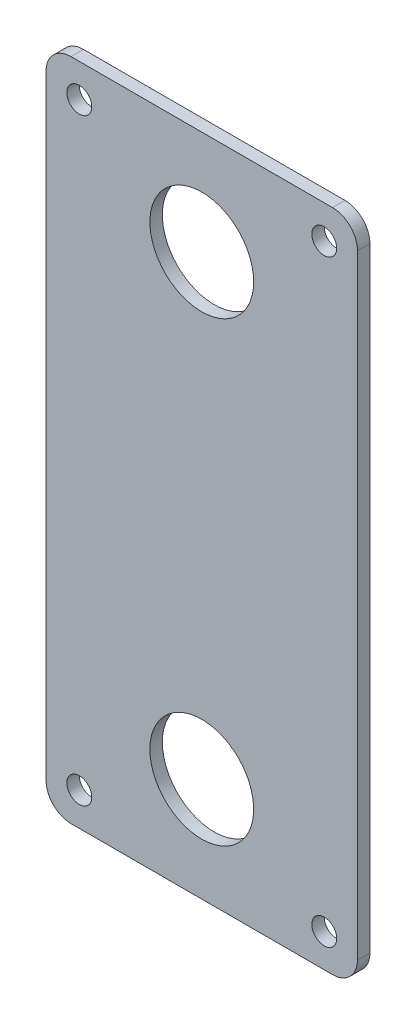
ISO-10303-21;
HEADER;
FILE_DESCRIPTION(('STEP AP214'),'2;1');
FILE_NAME('part.step','',(''),(''),'','','');
FILE_SCHEMA(('AUTOMOTIVE_DESIGN { 1 0 10303 214 1 1 1 1 }'));
ENDSEC;
DATA;
#1=APPLICATION_CONTEXT('core data for automotive mechanical design processes');
#2=APPLICATION_PROTOCOL_DEFINITION('international standard','automotive_design',2000,#1);
#3=PRODUCT_CONTEXT('',#1,'mechanical');
#4=PRODUCT('Part','Part','',(#3));
#5=PRODUCT_RELATED_PRODUCT_CATEGORY('part','',(#4));
#6=PRODUCT_DEFINITION_FORMATION('','',#4);
#7=PRODUCT_DEFINITION_CONTEXT('part definition',#1,'design');
#8=PRODUCT_DEFINITION('design','',#6,#7);
#9=PRODUCT_DEFINITION_SHAPE('','',#8);
#10=(LENGTH_UNIT() NAMED_UNIT(*) SI_UNIT(.MILLI.,.METRE.));
#11=(NAMED_UNIT(*) PLANE_ANGLE_UNIT() SI_UNIT($,.RADIAN.));
#12=(NAMED_UNIT(*) SI_UNIT($,.STERADIAN.) SOLID_ANGLE_UNIT());
#13=UNCERTAINTY_MEASURE_WITH_UNIT(LENGTH_MEASURE(1.E-05),#10,'distance_accuracy_value','');
#14=(GEOMETRIC_REPRESENTATION_CONTEXT(3) GLOBAL_UNCERTAINTY_ASSIGNED_CONTEXT((#13)) GLOBAL_UNIT_ASSIGNED_CONTEXT((#10,
#11,#12)) REPRESENTATION_CONTEXT('',''));
#15=CARTESIAN_POINT('',(0.,0.,0.));
#16=DIRECTION('',(0.,0.,1.));
#17=DIRECTION('',(1.,0.,0.));
#18=AXIS2_PLACEMENT_3D('',#15,#16,#17);
#19=CARTESIAN_POINT('',(0.,0.,3.));
#20=DIRECTION('',(0.,0.,-1.));
#21=DIRECTION('',(-1.,0.,0.));
#22=AXIS2_PLACEMENT_3D('',#19,#20,#21);
#23=PLANE('',#22);
#24=DIRECTION('',(0.,-1.,0.));
#25=VECTOR('',#24,1.);
#26=CARTESIAN_POINT('',(-37.5,80.,3.));
#27=LINE('',#26,#25);
#28=CARTESIAN_POINT('',(-37.5,74.,3.));
#29=VERTEX_POINT('',#28);
#30=CARTESIAN_POINT('',(-37.5,-74.,3.));
#31=VERTEX_POINT('',#30);
#32=EDGE_CURVE('E137',#29,#31,#27,.T.);
#33=ORIENTED_EDGE('',*,*,#32,.T.);
#34=CARTESIAN_POINT('',(-31.5,-74.,3.));
#35=DIRECTION('',(0.,0.,-1.));
#36=DIRECTION('',(-1.,0.,0.));
#37=AXIS2_PLACEMENT_3D('',#34,#35,#36);
#38=CIRCLE('',#37,6.);
#39=CARTESIAN_POINT('',(-31.5,-80.,3.));
#40=VERTEX_POINT('',#39);
#41=EDGE_CURVE('E152',#31,#40,#38,.F.);
#42=ORIENTED_EDGE('',*,*,#41,.T.);
#43=DIRECTION('',(1.,0.,0.));
#44=VECTOR('',#43,1.);
#45=CARTESIAN_POINT('',(37.5,-80.,3.));
#46=LINE('',#45,#44);
#47=CARTESIAN_POINT('',(31.5,-80.,3.));
#48=VERTEX_POINT('',#47);
#49=EDGE_CURVE('E119',#40,#48,#46,.T.);
#50=ORIENTED_EDGE('',*,*,#49,.T.);
#51=CARTESIAN_POINT('',(31.5,-74.,3.));
#52=DIRECTION('',(0.,0.,-1.));
#53=DIRECTION('',(-1.,0.,0.));
#54=AXIS2_PLACEMENT_3D('',#51,#52,#53);
#55=CIRCLE('',#54,6.);
#56=CARTESIAN_POINT('',(37.5,-74.,3.));
#57=VERTEX_POINT('',#56);
#58=EDGE_CURVE('E147',#48,#57,#55,.F.);
#59=ORIENTED_EDGE('',*,*,#58,.T.);
#60=DIRECTION('',(0.,1.,0.));
#61=VECTOR('',#60,1.);
#62=CARTESIAN_POINT('',(37.5,80.,3.));
#63=LINE('',#62,#61);
#64=CARTESIAN_POINT('',(37.5,74.,3.));
#65=VERTEX_POINT('',#64);
#66=EDGE_CURVE('E163',#57,#65,#63,.T.);
#67=ORIENTED_EDGE('',*,*,#66,.T.);
#68=CARTESIAN_POINT('',(31.5,74.,3.));
#69=DIRECTION('',(0.,0.,-1.));
#70=DIRECTION('',(-1.,0.,0.));
#71=AXIS2_PLACEMENT_3D('',#68,#69,#70);
#72=CIRCLE('',#71,6.);
#73=CARTESIAN_POINT('',(31.5,80.,3.));
#74=VERTEX_POINT('',#73);
#75=EDGE_CURVE('E55',#65,#74,#72,.F.);
#76=ORIENTED_EDGE('',*,*,#75,.T.);
#77=DIRECTION('',(-1.,0.,0.));
#78=VECTOR('',#77,1.);
#79=CARTESIAN_POINT('',(37.5,80.,3.));
#80=LINE('',#79,#78);
#81=CARTESIAN_POINT('',(-31.5,80.,3.));
#82=VERTEX_POINT('',#81);
#83=EDGE_CURVE('E138',#74,#82,#80,.T.);
#84=ORIENTED_EDGE('',*,*,#83,.T.);
#85=CARTESIAN_POINT('',(-31.5,74.,3.));
#86=DIRECTION('',(0.,0.,-1.));
#87=DIRECTION('',(-1.,0.,0.));
#88=AXIS2_PLACEMENT_3D('',#85,#86,#87);
#89=CIRCLE('',#88,6.);
#90=EDGE_CURVE('E150',#82,#29,#89,.F.);
#91=ORIENTED_EDGE('',*,*,#90,.T.);
#92=EDGE_LOOP('',(#33,#42,#50,#59,#67,#76,#84,#91));
#93=FACE_BOUND('',#92,.T.);
#94=CARTESIAN_POINT('',(0.,55.,3.));
#95=DIRECTION('',(0.,0.,1.));
#96=DIRECTION('',(1.,0.,0.));
#97=AXIS2_PLACEMENT_3D('',#94,#95,#96);
#98=CIRCLE('',#97,12.5);
#99=CARTESIAN_POINT('',(12.5,55.,3.));
#100=VERTEX_POINT('',#99);
#101=EDGE_CURVE('E132',#100,#100,#98,.T.);
#102=ORIENTED_EDGE('',*,*,#101,.F.);
#103=EDGE_LOOP('',(#102));
#104=FACE_BOUND('',#103,.T.);
#105=CARTESIAN_POINT('',(0.,-55.,3.));
#106=DIRECTION('',(0.,0.,1.));
#107=DIRECTION('',(-1.,0.,0.));
#108=AXIS2_PLACEMENT_3D('',#105,#106,#107);
#109=CIRCLE('',#108,12.5);
#110=CARTESIAN_POINT('',(-12.5,-55.,3.));
#111=VERTEX_POINT('',#110);
#112=EDGE_CURVE('E180',#111,#111,#109,.T.);
#113=ORIENTED_EDGE('',*,*,#112,.F.);
#114=EDGE_LOOP('',(#113));
#115=FACE_BOUND('',#114,.T.);
#116=CARTESIAN_POINT('',(-29.5,72.,3.));
#117=DIRECTION('',(0.,0.,1.));
#118=DIRECTION('',(1.,0.,0.));
#119=AXIS2_PLACEMENT_3D('',#116,#117,#118);
#120=CIRCLE('',#119,3.);
#121=CARTESIAN_POINT('',(-26.5,72.,3.));
#122=VERTEX_POINT('',#121);
#123=EDGE_CURVE('E186',#122,#122,#120,.T.);
#124=ORIENTED_EDGE('',*,*,#123,.F.);
#125=EDGE_LOOP('',(#124));
#126=FACE_BOUND('',#125,.T.);
#127=CARTESIAN_POINT('',(29.5,72.,3.));
#128=DIRECTION('',(0.,0.,1.));
#129=DIRECTION('',(-1.,0.,0.));
#130=AXIS2_PLACEMENT_3D('',#127,#128,#129);
#131=CIRCLE('',#130,3.);
#132=CARTESIAN_POINT('',(26.5,72.,3.));
#133=VERTEX_POINT('',#132);
#134=EDGE_CURVE('E192',#133,#133,#131,.T.);
#135=ORIENTED_EDGE('',*,*,#134,.F.);
#136=EDGE_LOOP('',(#135));
#137=FACE_BOUND('',#136,.T.);
#138=CARTESIAN_POINT('',(-29.5,-72.,3.));
#139=DIRECTION('',(0.,0.,1.));
#140=DIRECTION('',(-1.,0.,0.));
#141=AXIS2_PLACEMENT_3D('',#138,#139,#140);
#142=CIRCLE('',#141,3.);
#143=CARTESIAN_POINT('',(-32.5,-72.,3.));
#144=VERTEX_POINT('',#143);
#145=EDGE_CURVE('E198',#144,#144,#142,.T.);
#146=ORIENTED_EDGE('',*,*,#145,.F.);
#147=EDGE_LOOP('',(#146));
#148=FACE_BOUND('',#147,.T.);
#149=CARTESIAN_POINT('',(29.5,-72.,3.));
#150=DIRECTION('',(0.,0.,1.));
#151=DIRECTION('',(1.,0.,0.));
#152=AXIS2_PLACEMENT_3D('',#149,#150,#151);
#153=CIRCLE('',#152,3.);
#154=CARTESIAN_POINT('',(32.5,-72.,3.));
#155=VERTEX_POINT('',#154);
#156=EDGE_CURVE('E204',#155,#155,#153,.T.);
#157=ORIENTED_EDGE('',*,*,#156,.F.);
#158=EDGE_LOOP('',(#157));
#159=FACE_BOUND('',#158,.T.);
#160=ADVANCED_FACE('F33',(#93,#104,#115,#126,#137,#148,#159),#23,.F.);
#161=CARTESIAN_POINT('',(0.,0.,0.));
#162=DIRECTION('',(0.,0.,-1.));
#163=DIRECTION('',(-1.,0.,0.));
#164=AXIS2_PLACEMENT_3D('',#161,#162,#163);
#165=PLANE('',#164);
#166=CARTESIAN_POINT('',(-29.5,-72.,0.));
#167=DIRECTION('',(0.,0.,1.));
#168=DIRECTION('',(-1.,0.,0.));
#169=AXIS2_PLACEMENT_3D('',#166,#167,#168);
#170=CIRCLE('',#169,3.);
#171=CARTESIAN_POINT('',(-32.5,-72.,0.));
#172=VERTEX_POINT('',#171);
#173=EDGE_CURVE('E201',#172,#172,#170,.T.);
#174=ORIENTED_EDGE('',*,*,#173,.T.);
#175=EDGE_LOOP('',(#174));
#176=FACE_BOUND('',#175,.T.);
#177=CARTESIAN_POINT('',(-29.5,72.,0.));
#178=DIRECTION('',(0.,0.,1.));
#179=DIRECTION('',(1.,0.,0.));
#180=AXIS2_PLACEMENT_3D('',#177,#178,#179);
#181=CIRCLE('',#180,3.);
#182=CARTESIAN_POINT('',(-26.5,72.,0.));
#183=VERTEX_POINT('',#182);
#184=EDGE_CURVE('E189',#183,#183,#181,.T.);
#185=ORIENTED_EDGE('',*,*,#184,.T.);
#186=EDGE_LOOP('',(#185));
#187=FACE_BOUND('',#186,.T.);
#188=CARTESIAN_POINT('',(0.,55.,0.));
#189=DIRECTION('',(0.,0.,1.));
#190=DIRECTION('',(1.,0.,0.));
#191=AXIS2_PLACEMENT_3D('',#188,#189,#190);
#192=CIRCLE('',#191,12.5);
#193=CARTESIAN_POINT('',(12.5,55.,0.));
#194=VERTEX_POINT('',#193);
#195=EDGE_CURVE('E177',#194,#194,#192,.T.);
#196=ORIENTED_EDGE('',*,*,#195,.T.);
#197=EDGE_LOOP('',(#196));
#198=FACE_BOUND('',#197,.T.);
#199=DIRECTION('',(1.,0.,0.));
#200=VECTOR('',#199,1.);
#201=CARTESIAN_POINT('',(37.5,-80.,0.));
#202=LINE('',#201,#200);
#203=CARTESIAN_POINT('',(-31.5,-80.,0.));
#204=VERTEX_POINT('',#203);
#205=CARTESIAN_POINT('',(31.5,-80.,0.));
#206=VERTEX_POINT('',#205);
#207=EDGE_CURVE('E116',#204,#206,#202,.T.);
#208=ORIENTED_EDGE('',*,*,#207,.F.);
#209=CARTESIAN_POINT('',(-31.5,-74.,0.));
#210=DIRECTION('',(0.,0.,-1.));
#211=DIRECTION('',(-1.,0.,0.));
#212=AXIS2_PLACEMENT_3D('',#209,#210,#211);
#213=CIRCLE('',#212,6.);
#214=CARTESIAN_POINT('',(-37.5,-74.,0.));
#215=VERTEX_POINT('',#214);
#216=EDGE_CURVE('E99',#204,#215,#213,.T.);
#217=ORIENTED_EDGE('',*,*,#216,.T.);
#218=DIRECTION('',(0.,-1.,0.));
#219=VECTOR('',#218,1.);
#220=CARTESIAN_POINT('',(-37.5,80.,0.));
#221=LINE('',#220,#219);
#222=CARTESIAN_POINT('',(-37.5,74.,0.));
#223=VERTEX_POINT('',#222);
#224=EDGE_CURVE('E127',#223,#215,#221,.T.);
#225=ORIENTED_EDGE('',*,*,#224,.F.);
#226=CARTESIAN_POINT('',(-31.5,74.,0.));
#227=DIRECTION('',(0.,0.,-1.));
#228=DIRECTION('',(-1.,0.,0.));
#229=AXIS2_PLACEMENT_3D('',#226,#227,#228);
#230=CIRCLE('',#229,6.);
#231=CARTESIAN_POINT('',(-31.5,80.,0.));
#232=VERTEX_POINT('',#231);
#233=EDGE_CURVE('E110',#223,#232,#230,.T.);
#234=ORIENTED_EDGE('',*,*,#233,.T.);
#235=DIRECTION('',(-1.,0.,0.));
#236=VECTOR('',#235,1.);
#237=CARTESIAN_POINT('',(37.5,80.,0.));
#238=LINE('',#237,#236);
#239=CARTESIAN_POINT('',(31.5,80.,0.));
#240=VERTEX_POINT('',#239);
#241=EDGE_CURVE('E130',#240,#232,#238,.T.);
#242=ORIENTED_EDGE('',*,*,#241,.F.);
#243=CARTESIAN_POINT('',(31.5,74.,0.));
#244=DIRECTION('',(0.,0.,-1.));
#245=DIRECTION('',(-1.,0.,0.));
#246=AXIS2_PLACEMENT_3D('',#243,#244,#245);
#247=CIRCLE('',#246,6.);
#248=CARTESIAN_POINT('',(37.5,74.,0.));
#249=VERTEX_POINT('',#248);
#250=EDGE_CURVE('E141',#240,#249,#247,.T.);
#251=ORIENTED_EDGE('',*,*,#250,.T.);
#252=DIRECTION('',(0.,1.,0.));
#253=VECTOR('',#252,1.);
#254=CARTESIAN_POINT('',(37.5,80.,0.));
#255=LINE('',#254,#253);
#256=CARTESIAN_POINT('',(37.5,-74.,0.));
#257=VERTEX_POINT('',#256);
#258=EDGE_CURVE('E126',#257,#249,#255,.T.);
#259=ORIENTED_EDGE('',*,*,#258,.F.);
#260=CARTESIAN_POINT('',(31.5,-74.,0.));
#261=DIRECTION('',(0.,0.,-1.));
#262=DIRECTION('',(-1.,0.,0.));
#263=AXIS2_PLACEMENT_3D('',#260,#261,#262);
#264=CIRCLE('',#263,6.);
#265=EDGE_CURVE('E120',#257,#206,#264,.T.);
#266=ORIENTED_EDGE('',*,*,#265,.T.);
#267=EDGE_LOOP('',(#208,#217,#225,#234,#242,#251,#259,#266));
#268=FACE_BOUND('',#267,.T.);
#269=CARTESIAN_POINT('',(0.,-55.,0.));
#270=DIRECTION('',(0.,0.,1.));
#271=DIRECTION('',(-1.,0.,0.));
#272=AXIS2_PLACEMENT_3D('',#269,#270,#271);
#273=CIRCLE('',#272,12.5);
#274=CARTESIAN_POINT('',(-12.5,-55.,0.));
#275=VERTEX_POINT('',#274);
#276=EDGE_CURVE('E183',#275,#275,#273,.T.);
#277=ORIENTED_EDGE('',*,*,#276,.T.);
#278=EDGE_LOOP('',(#277));
#279=FACE_BOUND('',#278,.T.);
#280=CARTESIAN_POINT('',(29.5,72.,0.));
#281=DIRECTION('',(0.,0.,1.));
#282=DIRECTION('',(-1.,0.,0.));
#283=AXIS2_PLACEMENT_3D('',#280,#281,#282);
#284=CIRCLE('',#283,3.);
#285=CARTESIAN_POINT('',(26.5,72.,0.));
#286=VERTEX_POINT('',#285);
#287=EDGE_CURVE('E195',#286,#286,#284,.T.);
#288=ORIENTED_EDGE('',*,*,#287,.T.);
#289=EDGE_LOOP('',(#288));
#290=FACE_BOUND('',#289,.T.);
#291=CARTESIAN_POINT('',(29.5,-72.,0.));
#292=DIRECTION('',(0.,0.,1.));
#293=DIRECTION('',(1.,0.,0.));
#294=AXIS2_PLACEMENT_3D('',#291,#292,#293);
#295=CIRCLE('',#294,3.);
#296=CARTESIAN_POINT('',(32.5,-72.,0.));
#297=VERTEX_POINT('',#296);
#298=EDGE_CURVE('E207',#297,#297,#295,.T.);
#299=ORIENTED_EDGE('',*,*,#298,.T.);
#300=EDGE_LOOP('',(#299));
#301=FACE_BOUND('',#300,.T.);
#302=ADVANCED_FACE('F123',(#176,#187,#198,#268,#279,#290,#301),#165,.T.);
#303=CARTESIAN_POINT('',(-37.5,80.,3.));
#304=DIRECTION('',(1.,0.,0.));
#305=DIRECTION('',(0.,1.,0.));
#306=AXIS2_PLACEMENT_3D('',#303,#304,#305);
#307=PLANE('',#306);
#308=ORIENTED_EDGE('',*,*,#224,.T.);
#309=DIRECTION('',(0.,0.,-1.));
#310=VECTOR('',#309,1.);
#311=CARTESIAN_POINT('',(-37.5,-74.,3.));
#312=LINE('',#311,#310);
#313=EDGE_CURVE('E104',#215,#31,#312,.F.);
#314=ORIENTED_EDGE('',*,*,#313,.T.);
#315=ORIENTED_EDGE('',*,*,#32,.F.);
#316=DIRECTION('',(0.,0.,-1.));
#317=VECTOR('',#316,1.);
#318=CARTESIAN_POINT('',(-37.5,74.,3.));
#319=LINE('',#318,#317);
#320=EDGE_CURVE('E109',#29,#223,#319,.T.);
#321=ORIENTED_EDGE('',*,*,#320,.T.);
#322=EDGE_LOOP('',(#308,#314,#315,#321));
#323=FACE_BOUND('',#322,.T.);
#324=ADVANCED_FACE('F221',(#323),#307,.F.);
#325=CARTESIAN_POINT('',(37.5,-80.,3.));
#326=DIRECTION('',(0.,1.,0.));
#327=DIRECTION('',(-1.,0.,0.));
#328=AXIS2_PLACEMENT_3D('',#325,#326,#327);
#329=PLANE('',#328);
#330=ORIENTED_EDGE('',*,*,#49,.F.);
#331=DIRECTION('',(0.,0.,-1.));
#332=VECTOR('',#331,1.);
#333=CARTESIAN_POINT('',(-31.5,-80.,3.));
#334=LINE('',#333,#332);
#335=EDGE_CURVE('E103',#40,#204,#334,.T.);
#336=ORIENTED_EDGE('',*,*,#335,.T.);
#337=ORIENTED_EDGE('',*,*,#207,.T.);
#338=DIRECTION('',(0.,0.,-1.));
#339=VECTOR('',#338,1.);
#340=CARTESIAN_POINT('',(31.5,-80.,3.));
#341=LINE('',#340,#339);
#342=EDGE_CURVE('E121',#206,#48,#341,.F.);
#343=ORIENTED_EDGE('',*,*,#342,.T.);
#344=EDGE_LOOP('',(#330,#336,#337,#343));
#345=FACE_BOUND('',#344,.T.);
#346=ADVANCED_FACE('F115',(#345),#329,.F.);
#347=CARTESIAN_POINT('',(37.5,80.,3.));
#348=DIRECTION('',(-1.,0.,0.));
#349=DIRECTION('',(0.,-1.,0.));
#350=AXIS2_PLACEMENT_3D('',#347,#348,#349);
#351=PLANE('',#350);
#352=ORIENTED_EDGE('',*,*,#258,.T.);
#353=DIRECTION('',(0.,0.,-1.));
#354=VECTOR('',#353,1.);
#355=CARTESIAN_POINT('',(37.5,74.,3.));
#356=LINE('',#355,#354);
#357=EDGE_CURVE('E11',#249,#65,#356,.F.);
#358=ORIENTED_EDGE('',*,*,#357,.T.);
#359=ORIENTED_EDGE('',*,*,#66,.F.);
#360=DIRECTION('',(0.,0.,-1.));
#361=VECTOR('',#360,1.);
#362=CARTESIAN_POINT('',(37.5,-74.,3.));
#363=LINE('',#362,#361);
#364=EDGE_CURVE('E41',#57,#257,#363,.T.);
#365=ORIENTED_EDGE('',*,*,#364,.T.);
#366=EDGE_LOOP('',(#352,#358,#359,#365));
#367=FACE_BOUND('',#366,.T.);
#368=ADVANCED_FACE('F161',(#367),#351,.F.);
#369=CARTESIAN_POINT('',(37.5,80.,3.));
#370=DIRECTION('',(0.,-1.,0.));
#371=DIRECTION('',(0.,0.,-1.));
#372=AXIS2_PLACEMENT_3D('',#369,#370,#371);
#373=PLANE('',#372);
#374=ORIENTED_EDGE('',*,*,#241,.T.);
#375=DIRECTION('',(0.,0.,-1.));
#376=VECTOR('',#375,1.);
#377=CARTESIAN_POINT('',(-31.5,80.,3.));
#378=LINE('',#377,#376);
#379=EDGE_CURVE('E48',#232,#82,#378,.F.);
#380=ORIENTED_EDGE('',*,*,#379,.T.);
#381=ORIENTED_EDGE('',*,*,#83,.F.);
#382=DIRECTION('',(0.,0.,-1.));
#383=VECTOR('',#382,1.);
#384=CARTESIAN_POINT('',(31.5,80.,3.));
#385=LINE('',#384,#383);
#386=EDGE_CURVE('E154',#74,#240,#385,.T.);
#387=ORIENTED_EDGE('',*,*,#386,.T.);
#388=EDGE_LOOP('',(#374,#380,#381,#387));
#389=FACE_BOUND('',#388,.T.);
#390=ADVANCED_FACE('F170',(#389),#373,.F.);
#391=CARTESIAN_POINT('',(0.,55.,3.));
#392=DIRECTION('',(0.,0.,-1.));
#393=DIRECTION('',(-1.,0.,0.));
#394=AXIS2_PLACEMENT_3D('',#391,#392,#393);
#395=CYLINDRICAL_SURFACE('',#394,12.5);
#396=ORIENTED_EDGE('',*,*,#101,.T.);
#397=EDGE_LOOP('',(#396));
#398=FACE_BOUND('',#397,.T.);
#399=ORIENTED_EDGE('',*,*,#195,.F.);
#400=EDGE_LOOP('',(#399));
#401=FACE_BOUND('',#400,.T.);
#402=ADVANCED_FACE('F226',(#398,#401),#395,.F.);
#403=CARTESIAN_POINT('',(0.,-55.,3.));
#404=DIRECTION('',(0.,0.,-1.));
#405=DIRECTION('',(-1.,0.,0.));
#406=AXIS2_PLACEMENT_3D('',#403,#404,#405);
#407=CYLINDRICAL_SURFACE('',#406,12.5);
#408=ORIENTED_EDGE('',*,*,#112,.T.);
#409=EDGE_LOOP('',(#408));
#410=FACE_BOUND('',#409,.T.);
#411=ORIENTED_EDGE('',*,*,#276,.F.);
#412=EDGE_LOOP('',(#411));
#413=FACE_BOUND('',#412,.T.);
#414=ADVANCED_FACE('F341',(#410,#413),#407,.F.);
#415=CARTESIAN_POINT('',(-29.5,72.,3.));
#416=DIRECTION('',(0.,0.,-1.));
#417=DIRECTION('',(-1.,0.,0.));
#418=AXIS2_PLACEMENT_3D('',#415,#416,#417);
#419=CYLINDRICAL_SURFACE('',#418,3.);
#420=ORIENTED_EDGE('',*,*,#123,.T.);
#421=EDGE_LOOP('',(#420));
#422=FACE_BOUND('',#421,.T.);
#423=ORIENTED_EDGE('',*,*,#184,.F.);
#424=EDGE_LOOP('',(#423));
#425=FACE_BOUND('',#424,.T.);
#426=ADVANCED_FACE('F331',(#422,#425),#419,.F.);
#427=CARTESIAN_POINT('',(29.5,72.,3.));
#428=DIRECTION('',(0.,0.,-1.));
#429=DIRECTION('',(-1.,0.,0.));
#430=AXIS2_PLACEMENT_3D('',#427,#428,#429);
#431=CYLINDRICAL_SURFACE('',#430,3.);
#432=ORIENTED_EDGE('',*,*,#134,.T.);
#433=EDGE_LOOP('',(#432));
#434=FACE_BOUND('',#433,.T.);
#435=ORIENTED_EDGE('',*,*,#287,.F.);
#436=EDGE_LOOP('',(#435));
#437=FACE_BOUND('',#436,.T.);
#438=ADVANCED_FACE('F321',(#434,#437),#431,.F.);
#439=CARTESIAN_POINT('',(-29.5,-72.,3.));
#440=DIRECTION('',(0.,0.,-1.));
#441=DIRECTION('',(-1.,0.,0.));
#442=AXIS2_PLACEMENT_3D('',#439,#440,#441);
#443=CYLINDRICAL_SURFACE('',#442,3.);
#444=ORIENTED_EDGE('',*,*,#145,.T.);
#445=EDGE_LOOP('',(#444));
#446=FACE_BOUND('',#445,.T.);
#447=ORIENTED_EDGE('',*,*,#173,.F.);
#448=EDGE_LOOP('',(#447));
#449=FACE_BOUND('',#448,.T.);
#450=ADVANCED_FACE('F312',(#446,#449),#443,.F.);
#451=CARTESIAN_POINT('',(29.5,-72.,3.));
#452=DIRECTION('',(0.,0.,-1.));
#453=DIRECTION('',(-1.,0.,0.));
#454=AXIS2_PLACEMENT_3D('',#451,#452,#453);
#455=CYLINDRICAL_SURFACE('',#454,3.);
#456=ORIENTED_EDGE('',*,*,#156,.T.);
#457=EDGE_LOOP('',(#456));
#458=FACE_BOUND('',#457,.T.);
#459=ORIENTED_EDGE('',*,*,#298,.F.);
#460=EDGE_LOOP('',(#459));
#461=FACE_BOUND('',#460,.T.);
#462=ADVANCED_FACE('F213',(#458,#461),#455,.F.);
#463=CARTESIAN_POINT('',(-31.5,-74.,3.));
#464=DIRECTION('',(0.,0.,-1.));
#465=DIRECTION('',(-1.,0.,0.));
#466=AXIS2_PLACEMENT_3D('',#463,#464,#465);
#467=CYLINDRICAL_SURFACE('',#466,6.);
#468=ORIENTED_EDGE('',*,*,#41,.F.);
#469=ORIENTED_EDGE('',*,*,#313,.F.);
#470=ORIENTED_EDGE('',*,*,#216,.F.);
#471=ORIENTED_EDGE('',*,*,#335,.F.);
#472=EDGE_LOOP('',(#468,#469,#470,#471));
#473=FACE_BOUND('',#472,.T.);
#474=ADVANCED_FACE('F102',(#473),#467,.T.);
#475=CARTESIAN_POINT('',(-31.5,74.,3.));
#476=DIRECTION('',(0.,0.,-1.));
#477=DIRECTION('',(-1.,0.,0.));
#478=AXIS2_PLACEMENT_3D('',#475,#476,#477);
#479=CYLINDRICAL_SURFACE('',#478,6.);
#480=ORIENTED_EDGE('',*,*,#90,.F.);
#481=ORIENTED_EDGE('',*,*,#379,.F.);
#482=ORIENTED_EDGE('',*,*,#233,.F.);
#483=ORIENTED_EDGE('',*,*,#320,.F.);
#484=EDGE_LOOP('',(#480,#481,#482,#483));
#485=FACE_BOUND('',#484,.T.);
#486=ADVANCED_FACE('F240',(#485),#479,.T.);
#487=CARTESIAN_POINT('',(31.5,74.,3.));
#488=DIRECTION('',(0.,0.,-1.));
#489=DIRECTION('',(-1.,0.,0.));
#490=AXIS2_PLACEMENT_3D('',#487,#488,#489);
#491=CYLINDRICAL_SURFACE('',#490,6.);
#492=ORIENTED_EDGE('',*,*,#75,.F.);
#493=ORIENTED_EDGE('',*,*,#357,.F.);
#494=ORIENTED_EDGE('',*,*,#250,.F.);
#495=ORIENTED_EDGE('',*,*,#386,.F.);
#496=EDGE_LOOP('',(#492,#493,#494,#495));
#497=FACE_BOUND('',#496,.T.);
#498=ADVANCED_FACE('F169',(#497),#491,.T.);
#499=CARTESIAN_POINT('',(31.5,-74.,3.));
#500=DIRECTION('',(0.,0.,-1.));
#501=DIRECTION('',(-1.,0.,0.));
#502=AXIS2_PLACEMENT_3D('',#499,#500,#501);
#503=CYLINDRICAL_SURFACE('',#502,6.);
#504=ORIENTED_EDGE('',*,*,#58,.F.);
#505=ORIENTED_EDGE('',*,*,#342,.F.);
#506=ORIENTED_EDGE('',*,*,#265,.F.);
#507=ORIENTED_EDGE('',*,*,#364,.F.);
#508=EDGE_LOOP('',(#504,#505,#506,#507));
#509=FACE_BOUND('',#508,.T.);
#510=ADVANCED_FACE('F35',(#509),#503,.T.);
#511=CLOSED_SHELL('',(#160,#302,#324,#346,#368,#390,#402,#414,#426,#438,#450,#462,#474,#486,
#498,#510));
#512=MANIFOLD_SOLID_BREP('B2',#511);
#513=ADVANCED_BREP_SHAPE_REPRESENTATION('',(#18,#512),#14);
#514=SHAPE_DEFINITION_REPRESENTATION(#9,#513);
ENDSEC;
END-ISO-10303-21;
